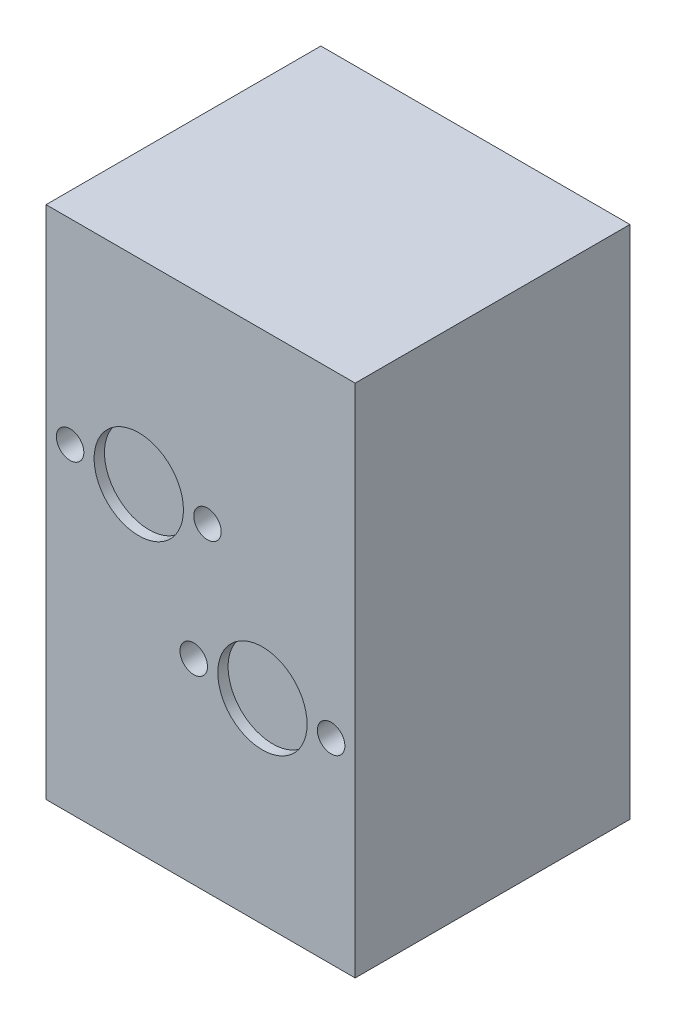
ISO-10303-21;
HEADER;
FILE_DESCRIPTION(('STEP AP214'),'2;1');
FILE_NAME('part.step','',(''),(''),'','','');
FILE_SCHEMA(('AUTOMOTIVE_DESIGN { 1 0 10303 214 1 1 1 1 }'));
ENDSEC;
DATA;
#1=APPLICATION_CONTEXT('core data for automotive mechanical design processes');
#2=APPLICATION_PROTOCOL_DEFINITION('international standard','automotive_design',2000,#1);
#3=PRODUCT_CONTEXT('',#1,'mechanical');
#4=PRODUCT('Part','Part','',(#3));
#5=PRODUCT_RELATED_PRODUCT_CATEGORY('part','',(#4));
#6=PRODUCT_DEFINITION_FORMATION('','',#4);
#7=PRODUCT_DEFINITION_CONTEXT('part definition',#1,'design');
#8=PRODUCT_DEFINITION('design','',#6,#7);
#9=PRODUCT_DEFINITION_SHAPE('','',#8);
#10=(LENGTH_UNIT() NAMED_UNIT(*) SI_UNIT(.MILLI.,.METRE.));
#11=(NAMED_UNIT(*) PLANE_ANGLE_UNIT() SI_UNIT($,.RADIAN.));
#12=(NAMED_UNIT(*) SI_UNIT($,.STERADIAN.) SOLID_ANGLE_UNIT());
#13=UNCERTAINTY_MEASURE_WITH_UNIT(LENGTH_MEASURE(1.E-05),#10,'distance_accuracy_value','');
#14=(GEOMETRIC_REPRESENTATION_CONTEXT(3) GLOBAL_UNCERTAINTY_ASSIGNED_CONTEXT((#13)) GLOBAL_UNIT_ASSIGNED_CONTEXT((#10,
#11,#12)) REPRESENTATION_CONTEXT('',''));
#15=CARTESIAN_POINT('',(0.,0.,0.));
#16=DIRECTION('',(0.,0.,1.));
#17=DIRECTION('',(1.,0.,0.));
#18=AXIS2_PLACEMENT_3D('',#15,#16,#17);
#19=CARTESIAN_POINT('',(45.,75.,80.));
#20=DIRECTION('',(-1.,0.,0.));
#21=DIRECTION('',(0.,-1.,0.));
#22=AXIS2_PLACEMENT_3D('',#19,#20,#21);
#23=PLANE('',#22);
#24=DIRECTION('',(0.,1.,0.));
#25=VECTOR('',#24,1.);
#26=CARTESIAN_POINT('',(45.,75.,0.));
#27=LINE('',#26,#25);
#28=CARTESIAN_POINT('',(45.,-75.,0.));
#29=VERTEX_POINT('',#28);
#30=CARTESIAN_POINT('',(45.,75.,0.));
#31=VERTEX_POINT('',#30);
#32=EDGE_CURVE('E95',#29,#31,#27,.T.);
#33=ORIENTED_EDGE('',*,*,#32,.T.);
#34=DIRECTION('',(0.,0.,-1.));
#35=VECTOR('',#34,1.);
#36=CARTESIAN_POINT('',(45.,75.,80.));
#37=LINE('',#36,#35);
#38=CARTESIAN_POINT('',(45.,75.,80.));
#39=VERTEX_POINT('',#38);
#40=EDGE_CURVE('E11',#39,#31,#37,.T.);
#41=ORIENTED_EDGE('',*,*,#40,.F.);
#42=DIRECTION('',(0.,1.,0.));
#43=VECTOR('',#42,1.);
#44=CARTESIAN_POINT('',(45.,75.,80.));
#45=LINE('',#44,#43);
#46=CARTESIAN_POINT('',(45.,-75.,80.));
#47=VERTEX_POINT('',#46);
#48=EDGE_CURVE('E83',#47,#39,#45,.T.);
#49=ORIENTED_EDGE('',*,*,#48,.F.);
#50=DIRECTION('',(0.,0.,-1.));
#51=VECTOR('',#50,1.);
#52=CARTESIAN_POINT('',(45.,-75.,80.));
#53=LINE('',#52,#51);
#54=EDGE_CURVE('E91',#47,#29,#53,.T.);
#55=ORIENTED_EDGE('',*,*,#54,.T.);
#56=EDGE_LOOP('',(#33,#41,#49,#55));
#57=FACE_BOUND('',#56,.T.);
#58=ADVANCED_FACE('F32',(#57),#23,.F.);
#59=CARTESIAN_POINT('',(-45.,75.,80.));
#60=DIRECTION('',(0.,-1.,0.));
#61=DIRECTION('',(0.,0.,-1.));
#62=AXIS2_PLACEMENT_3D('',#59,#60,#61);
#63=PLANE('',#62);
#64=DIRECTION('',(-1.,0.,0.));
#65=VECTOR('',#64,1.);
#66=CARTESIAN_POINT('',(-45.,75.,0.));
#67=LINE('',#66,#65);
#68=CARTESIAN_POINT('',(-45.,75.,0.));
#69=VERTEX_POINT('',#68);
#70=EDGE_CURVE('E87',#31,#69,#67,.T.);
#71=ORIENTED_EDGE('',*,*,#70,.T.);
#72=DIRECTION('',(0.,0.,-1.));
#73=VECTOR('',#72,1.);
#74=CARTESIAN_POINT('',(-45.,75.,80.));
#75=LINE('',#74,#73);
#76=CARTESIAN_POINT('',(-45.,75.,80.));
#77=VERTEX_POINT('',#76);
#78=EDGE_CURVE('E40',#77,#69,#75,.T.);
#79=ORIENTED_EDGE('',*,*,#78,.F.);
#80=DIRECTION('',(-1.,0.,0.));
#81=VECTOR('',#80,1.);
#82=CARTESIAN_POINT('',(-45.,75.,80.));
#83=LINE('',#82,#81);
#84=EDGE_CURVE('E78',#39,#77,#83,.T.);
#85=ORIENTED_EDGE('',*,*,#84,.F.);
#86=ORIENTED_EDGE('',*,*,#40,.T.);
#87=EDGE_LOOP('',(#71,#79,#85,#86));
#88=FACE_BOUND('',#87,.T.);
#89=ADVANCED_FACE('F86',(#88),#63,.F.);
#90=CARTESIAN_POINT('',(-45.,75.,80.));
#91=DIRECTION('',(1.,0.,0.));
#92=DIRECTION('',(0.,1.,0.));
#93=AXIS2_PLACEMENT_3D('',#90,#91,#92);
#94=PLANE('',#93);
#95=DIRECTION('',(0.,-1.,0.));
#96=VECTOR('',#95,1.);
#97=CARTESIAN_POINT('',(-45.,75.,0.));
#98=LINE('',#97,#96);
#99=CARTESIAN_POINT('',(-45.,-75.,0.));
#100=VERTEX_POINT('',#99);
#101=EDGE_CURVE('E65',#69,#100,#98,.T.);
#102=ORIENTED_EDGE('',*,*,#101,.T.);
#103=DIRECTION('',(0.,0.,-1.));
#104=VECTOR('',#103,1.);
#105=CARTESIAN_POINT('',(-45.,-75.,80.));
#106=LINE('',#105,#104);
#107=CARTESIAN_POINT('',(-45.,-75.,80.));
#108=VERTEX_POINT('',#107);
#109=EDGE_CURVE('E88',#108,#100,#106,.T.);
#110=ORIENTED_EDGE('',*,*,#109,.F.);
#111=DIRECTION('',(0.,-1.,0.));
#112=VECTOR('',#111,1.);
#113=CARTESIAN_POINT('',(-45.,75.,80.));
#114=LINE('',#113,#112);
#115=EDGE_CURVE('E81',#77,#108,#114,.T.);
#116=ORIENTED_EDGE('',*,*,#115,.F.);
#117=ORIENTED_EDGE('',*,*,#78,.T.);
#118=EDGE_LOOP('',(#102,#110,#116,#117));
#119=FACE_BOUND('',#118,.T.);
#120=ADVANCED_FACE('F89',(#119),#94,.F.);
#121=CARTESIAN_POINT('',(-45.,-75.,80.));
#122=DIRECTION('',(0.,1.,0.));
#123=DIRECTION('',(0.,0.,1.));
#124=AXIS2_PLACEMENT_3D('',#121,#122,#123);
#125=PLANE('',#124);
#126=DIRECTION('',(1.,0.,0.));
#127=VECTOR('',#126,1.);
#128=CARTESIAN_POINT('',(-45.,-75.,0.));
#129=LINE('',#128,#127);
#130=EDGE_CURVE('E71',#100,#29,#129,.T.);
#131=ORIENTED_EDGE('',*,*,#130,.T.);
#132=ORIENTED_EDGE('',*,*,#54,.F.);
#133=DIRECTION('',(1.,0.,0.));
#134=VECTOR('',#133,1.);
#135=CARTESIAN_POINT('',(-45.,-75.,80.));
#136=LINE('',#135,#134);
#137=EDGE_CURVE('E48',#108,#47,#136,.T.);
#138=ORIENTED_EDGE('',*,*,#137,.F.);
#139=ORIENTED_EDGE('',*,*,#109,.T.);
#140=EDGE_LOOP('',(#131,#132,#138,#139));
#141=FACE_BOUND('',#140,.T.);
#142=ADVANCED_FACE('F103',(#141),#125,.F.);
#143=CARTESIAN_POINT('',(45.,-75.,80.));
#144=DIRECTION('',(0.,0.,1.));
#145=DIRECTION('',(1.,0.,0.));
#146=AXIS2_PLACEMENT_3D('',#143,#144,#145);
#147=PLANE('',#146);
#148=CARTESIAN_POINT('',(38.0000000000005,-17.9999999999995,80.));
#149=DIRECTION('',(0.,0.,1.));
#150=DIRECTION('',(1.,0.,0.));
#151=AXIS2_PLACEMENT_3D('',#148,#149,#150);
#152=CIRCLE('',#151,4.00000000000084);
#153=CARTESIAN_POINT('',(42.0000000000013,-17.9999999999995,80.));
#154=VERTEX_POINT('',#153);
#155=EDGE_CURVE('E139',#154,#154,#152,.T.);
#156=ORIENTED_EDGE('',*,*,#155,.F.);
#157=EDGE_LOOP('',(#156));
#158=FACE_BOUND('',#157,.T.);
#159=CARTESIAN_POINT('',(-2.00000000000013,-18.,80.));
#160=DIRECTION('',(0.,0.,1.));
#161=DIRECTION('',(1.,0.,0.));
#162=AXIS2_PLACEMENT_3D('',#159,#160,#161);
#163=CIRCLE('',#162,4.);
#164=CARTESIAN_POINT('',(1.99999999999987,-18.,80.));
#165=VERTEX_POINT('',#164);
#166=EDGE_CURVE('E133',#165,#165,#163,.T.);
#167=ORIENTED_EDGE('',*,*,#166,.F.);
#168=EDGE_LOOP('',(#167));
#169=FACE_BOUND('',#168,.T.);
#170=CARTESIAN_POINT('',(-38.,18.,80.));
#171=DIRECTION('',(0.,0.,1.));
#172=DIRECTION('',(1.,0.,0.));
#173=AXIS2_PLACEMENT_3D('',#170,#171,#172);
#174=CIRCLE('',#173,4.00000000000001);
#175=CARTESIAN_POINT('',(-34.,18.,80.));
#176=VERTEX_POINT('',#175);
#177=EDGE_CURVE('E127',#176,#176,#174,.T.);
#178=ORIENTED_EDGE('',*,*,#177,.F.);
#179=EDGE_LOOP('',(#178));
#180=FACE_BOUND('',#179,.T.);
#181=CARTESIAN_POINT('',(2.,18.,80.));
#182=DIRECTION('',(0.,0.,1.));
#183=DIRECTION('',(1.,0.,0.));
#184=AXIS2_PLACEMENT_3D('',#181,#182,#183);
#185=CIRCLE('',#184,4.);
#186=CARTESIAN_POINT('',(6.,18.,80.));
#187=VERTEX_POINT('',#186);
#188=EDGE_CURVE('E121',#187,#187,#185,.T.);
#189=ORIENTED_EDGE('',*,*,#188,.F.);
#190=EDGE_LOOP('',(#189));
#191=FACE_BOUND('',#190,.T.);
#192=CARTESIAN_POINT('',(-18.,18.,80.));
#193=DIRECTION('',(0.,0.,1.));
#194=DIRECTION('',(1.,0.,0.));
#195=AXIS2_PLACEMENT_3D('',#192,#193,#194);
#196=CIRCLE('',#195,13.);
#197=CARTESIAN_POINT('',(-5.,18.,80.));
#198=VERTEX_POINT('',#197);
#199=EDGE_CURVE('E115',#198,#198,#196,.T.);
#200=ORIENTED_EDGE('',*,*,#199,.F.);
#201=EDGE_LOOP('',(#200));
#202=FACE_BOUND('',#201,.T.);
#203=CARTESIAN_POINT('',(18.,-18.,80.));
#204=DIRECTION('',(0.,0.,1.));
#205=DIRECTION('',(1.,0.,0.));
#206=AXIS2_PLACEMENT_3D('',#203,#204,#205);
#207=CIRCLE('',#206,13.);
#208=CARTESIAN_POINT('',(31.,-18.,80.));
#209=VERTEX_POINT('',#208);
#210=EDGE_CURVE('E109',#209,#209,#207,.T.);
#211=ORIENTED_EDGE('',*,*,#210,.F.);
#212=EDGE_LOOP('',(#211));
#213=FACE_BOUND('',#212,.T.);
#214=ORIENTED_EDGE('',*,*,#48,.T.);
#215=ORIENTED_EDGE('',*,*,#84,.T.);
#216=ORIENTED_EDGE('',*,*,#115,.T.);
#217=ORIENTED_EDGE('',*,*,#137,.T.);
#218=EDGE_LOOP('',(#214,#215,#216,#217));
#219=FACE_BOUND('',#218,.T.);
#220=ADVANCED_FACE('F79',(#158,#169,#180,#191,#202,#213,#219),#147,.T.);
#221=CARTESIAN_POINT('',(45.,-75.,0.));
#222=DIRECTION('',(0.,0.,1.));
#223=DIRECTION('',(1.,0.,0.));
#224=AXIS2_PLACEMENT_3D('',#221,#222,#223);
#225=PLANE('',#224);
#226=CARTESIAN_POINT('',(-19.4999999999999,60.3729833462074,0.));
#227=DIRECTION('',(0.,0.,-1.));
#228=DIRECTION('',(-1.,0.,0.));
#229=AXIS2_PLACEMENT_3D('',#226,#227,#228);
#230=CIRCLE('',#229,4.);
#231=CARTESIAN_POINT('',(-23.4999999999999,60.3729833462074,0.));
#232=VERTEX_POINT('',#231);
#233=EDGE_CURVE('E187',#232,#232,#230,.T.);
#234=ORIENTED_EDGE('',*,*,#233,.F.);
#235=EDGE_LOOP('',(#234));
#236=FACE_BOUND('',#235,.T.);
#237=CARTESIAN_POINT('',(-19.4999999999999,34.6270166537926,0.));
#238=DIRECTION('',(0.,0.,-1.));
#239=DIRECTION('',(-1.,0.,0.));
#240=AXIS2_PLACEMENT_3D('',#237,#238,#239);
#241=CIRCLE('',#240,4.);
#242=CARTESIAN_POINT('',(-23.4999999999999,34.6270166537926,0.));
#243=VERTEX_POINT('',#242);
#244=EDGE_CURVE('E181',#243,#243,#241,.T.);
#245=ORIENTED_EDGE('',*,*,#244,.F.);
#246=EDGE_LOOP('',(#245));
#247=FACE_BOUND('',#246,.T.);
#248=CARTESIAN_POINT('',(-19.5,-60.3729833462074,0.));
#249=DIRECTION('',(0.,0.,-1.));
#250=DIRECTION('',(-1.,0.,0.));
#251=AXIS2_PLACEMENT_3D('',#248,#249,#250);
#252=CIRCLE('',#251,4.);
#253=CARTESIAN_POINT('',(-23.5,-60.3729833462074,0.));
#254=VERTEX_POINT('',#253);
#255=EDGE_CURVE('E175',#254,#254,#252,.T.);
#256=ORIENTED_EDGE('',*,*,#255,.F.);
#257=EDGE_LOOP('',(#256));
#258=FACE_BOUND('',#257,.T.);
#259=CARTESIAN_POINT('',(19.5,-60.3729833462074,0.));
#260=DIRECTION('',(0.,0.,-1.));
#261=DIRECTION('',(-1.,0.,0.));
#262=AXIS2_PLACEMENT_3D('',#259,#260,#261);
#263=CIRCLE('',#262,4.);
#264=CARTESIAN_POINT('',(15.5,-60.3729833462074,0.));
#265=VERTEX_POINT('',#264);
#266=EDGE_CURVE('E169',#265,#265,#263,.T.);
#267=ORIENTED_EDGE('',*,*,#266,.F.);
#268=EDGE_LOOP('',(#267));
#269=FACE_BOUND('',#268,.T.);
#270=CARTESIAN_POINT('',(19.5,34.6270166537926,0.));
#271=DIRECTION('',(0.,0.,-1.));
#272=DIRECTION('',(-1.,0.,0.));
#273=AXIS2_PLACEMENT_3D('',#270,#271,#272);
#274=CIRCLE('',#273,4.);
#275=CARTESIAN_POINT('',(15.5,34.6270166537926,0.));
#276=VERTEX_POINT('',#275);
#277=EDGE_CURVE('E163',#276,#276,#274,.T.);
#278=ORIENTED_EDGE('',*,*,#277,.F.);
#279=EDGE_LOOP('',(#278));
#280=FACE_BOUND('',#279,.T.);
#281=CARTESIAN_POINT('',(-19.5,-34.6270166537926,0.));
#282=DIRECTION('',(0.,0.,-1.));
#283=DIRECTION('',(-1.,0.,0.));
#284=AXIS2_PLACEMENT_3D('',#281,#282,#283);
#285=CIRCLE('',#284,4.);
#286=CARTESIAN_POINT('',(-23.5,-34.6270166537926,0.));
#287=VERTEX_POINT('',#286);
#288=EDGE_CURVE('E157',#287,#287,#285,.T.);
#289=ORIENTED_EDGE('',*,*,#288,.F.);
#290=EDGE_LOOP('',(#289));
#291=FACE_BOUND('',#290,.T.);
#292=CARTESIAN_POINT('',(19.5,-34.6270166537926,0.));
#293=DIRECTION('',(0.,0.,-1.));
#294=DIRECTION('',(-1.,0.,0.));
#295=AXIS2_PLACEMENT_3D('',#292,#293,#294);
#296=CIRCLE('',#295,4.);
#297=CARTESIAN_POINT('',(15.5,-34.6270166537926,0.));
#298=VERTEX_POINT('',#297);
#299=EDGE_CURVE('E151',#298,#298,#296,.T.);
#300=ORIENTED_EDGE('',*,*,#299,.F.);
#301=EDGE_LOOP('',(#300));
#302=FACE_BOUND('',#301,.T.);
#303=CARTESIAN_POINT('',(19.5,60.3729833462074,0.));
#304=DIRECTION('',(0.,0.,-1.));
#305=DIRECTION('',(-1.,0.,0.));
#306=AXIS2_PLACEMENT_3D('',#303,#304,#305);
#307=CIRCLE('',#306,4.);
#308=CARTESIAN_POINT('',(15.5,60.3729833462074,0.));
#309=VERTEX_POINT('',#308);
#310=EDGE_CURVE('E145',#309,#309,#307,.T.);
#311=ORIENTED_EDGE('',*,*,#310,.F.);
#312=EDGE_LOOP('',(#311));
#313=FACE_BOUND('',#312,.T.);
#314=ORIENTED_EDGE('',*,*,#32,.F.);
#315=ORIENTED_EDGE('',*,*,#130,.F.);
#316=ORIENTED_EDGE('',*,*,#101,.F.);
#317=ORIENTED_EDGE('',*,*,#70,.F.);
#318=EDGE_LOOP('',(#314,#315,#316,#317));
#319=FACE_BOUND('',#318,.T.);
#320=ADVANCED_FACE('F106',(#236,#247,#258,#269,#280,#291,#302,#313,#319),#225,.F.);
#321=CARTESIAN_POINT('',(18.,-18.,77.));
#322=DIRECTION('',(0.,0.,1.));
#323=DIRECTION('',(1.,0.,0.));
#324=AXIS2_PLACEMENT_3D('',#321,#322,#323);
#325=CYLINDRICAL_SURFACE('',#324,13.);
#326=CARTESIAN_POINT('',(18.,-18.,77.));
#327=DIRECTION('',(0.,0.,1.));
#328=DIRECTION('',(1.,0.,0.));
#329=AXIS2_PLACEMENT_3D('',#326,#327,#328);
#330=CIRCLE('',#329,13.);
#331=CARTESIAN_POINT('',(31.,-18.,77.));
#332=VERTEX_POINT('',#331);
#333=EDGE_CURVE('E98',#332,#332,#330,.T.);
#334=ORIENTED_EDGE('',*,*,#333,.F.);
#335=EDGE_LOOP('',(#334));
#336=FACE_BOUND('',#335,.T.);
#337=ORIENTED_EDGE('',*,*,#210,.T.);
#338=EDGE_LOOP('',(#337));
#339=FACE_BOUND('',#338,.T.);
#340=ADVANCED_FACE('F204',(#336,#339),#325,.F.);
#341=CARTESIAN_POINT('',(18.,-18.,77.));
#342=DIRECTION('',(0.,0.,1.));
#343=DIRECTION('',(1.,0.,0.));
#344=AXIS2_PLACEMENT_3D('',#341,#342,#343);
#345=PLANE('',#344);
#346=ORIENTED_EDGE('',*,*,#333,.T.);
#347=EDGE_LOOP('',(#346));
#348=FACE_BOUND('',#347,.T.);
#349=ADVANCED_FACE('F253',(#348),#345,.T.);
#350=CARTESIAN_POINT('',(-18.,18.,77.));
#351=DIRECTION('',(0.,0.,1.));
#352=DIRECTION('',(1.,0.,0.));
#353=AXIS2_PLACEMENT_3D('',#350,#351,#352);
#354=CYLINDRICAL_SURFACE('',#353,13.);
#355=CARTESIAN_POINT('',(-18.,18.,77.));
#356=DIRECTION('',(0.,0.,1.));
#357=DIRECTION('',(1.,0.,0.));
#358=AXIS2_PLACEMENT_3D('',#355,#356,#357);
#359=CIRCLE('',#358,13.);
#360=CARTESIAN_POINT('',(-5.,18.,77.));
#361=VERTEX_POINT('',#360);
#362=EDGE_CURVE('E112',#361,#361,#359,.T.);
#363=ORIENTED_EDGE('',*,*,#362,.F.);
#364=EDGE_LOOP('',(#363));
#365=FACE_BOUND('',#364,.T.);
#366=ORIENTED_EDGE('',*,*,#199,.T.);
#367=EDGE_LOOP('',(#366));
#368=FACE_BOUND('',#367,.T.);
#369=ADVANCED_FACE('F257',(#365,#368),#354,.F.);
#370=CARTESIAN_POINT('',(-18.,18.,77.));
#371=DIRECTION('',(0.,0.,1.));
#372=DIRECTION('',(1.,0.,0.));
#373=AXIS2_PLACEMENT_3D('',#370,#371,#372);
#374=PLANE('',#373);
#375=ORIENTED_EDGE('',*,*,#362,.T.);
#376=EDGE_LOOP('',(#375));
#377=FACE_BOUND('',#376,.T.);
#378=ADVANCED_FACE('F261',(#377),#374,.T.);
#379=CARTESIAN_POINT('',(2.,18.,70.));
#380=DIRECTION('',(0.,0.,1.));
#381=DIRECTION('',(1.,0.,0.));
#382=AXIS2_PLACEMENT_3D('',#379,#380,#381);
#383=CYLINDRICAL_SURFACE('',#382,4.);
#384=CARTESIAN_POINT('',(2.,18.,70.));
#385=DIRECTION('',(0.,0.,1.));
#386=DIRECTION('',(1.,0.,0.));
#387=AXIS2_PLACEMENT_3D('',#384,#385,#386);
#388=CIRCLE('',#387,4.);
#389=CARTESIAN_POINT('',(6.,18.,70.));
#390=VERTEX_POINT('',#389);
#391=EDGE_CURVE('E118',#390,#390,#388,.T.);
#392=ORIENTED_EDGE('',*,*,#391,.F.);
#393=EDGE_LOOP('',(#392));
#394=FACE_BOUND('',#393,.T.);
#395=ORIENTED_EDGE('',*,*,#188,.T.);
#396=EDGE_LOOP('',(#395));
#397=FACE_BOUND('',#396,.T.);
#398=ADVANCED_FACE('F265',(#394,#397),#383,.F.);
#399=CARTESIAN_POINT('',(2.,18.,70.));
#400=DIRECTION('',(0.,0.,1.));
#401=DIRECTION('',(1.,0.,0.));
#402=AXIS2_PLACEMENT_3D('',#399,#400,#401);
#403=PLANE('',#402);
#404=ORIENTED_EDGE('',*,*,#391,.T.);
#405=EDGE_LOOP('',(#404));
#406=FACE_BOUND('',#405,.T.);
#407=ADVANCED_FACE('F269',(#406),#403,.T.);
#408=CARTESIAN_POINT('',(-38.,18.,70.));
#409=DIRECTION('',(0.,0.,1.));
#410=DIRECTION('',(1.,0.,0.));
#411=AXIS2_PLACEMENT_3D('',#408,#409,#410);
#412=CYLINDRICAL_SURFACE('',#411,4.00000000000001);
#413=CARTESIAN_POINT('',(-38.,18.,70.));
#414=DIRECTION('',(0.,0.,1.));
#415=DIRECTION('',(1.,0.,0.));
#416=AXIS2_PLACEMENT_3D('',#413,#414,#415);
#417=CIRCLE('',#416,4.00000000000001);
#418=CARTESIAN_POINT('',(-34.,18.,70.));
#419=VERTEX_POINT('',#418);
#420=EDGE_CURVE('E124',#419,#419,#417,.T.);
#421=ORIENTED_EDGE('',*,*,#420,.F.);
#422=EDGE_LOOP('',(#421));
#423=FACE_BOUND('',#422,.T.);
#424=ORIENTED_EDGE('',*,*,#177,.T.);
#425=EDGE_LOOP('',(#424));
#426=FACE_BOUND('',#425,.T.);
#427=ADVANCED_FACE('F273',(#423,#426),#412,.F.);
#428=CARTESIAN_POINT('',(-38.,18.,70.));
#429=DIRECTION('',(0.,0.,1.));
#430=DIRECTION('',(1.,0.,0.));
#431=AXIS2_PLACEMENT_3D('',#428,#429,#430);
#432=PLANE('',#431);
#433=ORIENTED_EDGE('',*,*,#420,.T.);
#434=EDGE_LOOP('',(#433));
#435=FACE_BOUND('',#434,.T.);
#436=ADVANCED_FACE('F277',(#435),#432,.T.);
#437=CARTESIAN_POINT('',(-2.00000000000013,-18.,70.));
#438=DIRECTION('',(0.,0.,1.));
#439=DIRECTION('',(1.,0.,0.));
#440=AXIS2_PLACEMENT_3D('',#437,#438,#439);
#441=CYLINDRICAL_SURFACE('',#440,4.);
#442=CARTESIAN_POINT('',(-2.00000000000013,-18.,70.));
#443=DIRECTION('',(0.,0.,1.));
#444=DIRECTION('',(1.,0.,0.));
#445=AXIS2_PLACEMENT_3D('',#442,#443,#444);
#446=CIRCLE('',#445,4.);
#447=CARTESIAN_POINT('',(1.99999999999987,-18.,70.));
#448=VERTEX_POINT('',#447);
#449=EDGE_CURVE('E130',#448,#448,#446,.T.);
#450=ORIENTED_EDGE('',*,*,#449,.F.);
#451=EDGE_LOOP('',(#450));
#452=FACE_BOUND('',#451,.T.);
#453=ORIENTED_EDGE('',*,*,#166,.T.);
#454=EDGE_LOOP('',(#453));
#455=FACE_BOUND('',#454,.T.);
#456=ADVANCED_FACE('F281',(#452,#455),#441,.F.);
#457=CARTESIAN_POINT('',(-2.00000000000013,-18.,70.));
#458=DIRECTION('',(0.,0.,1.));
#459=DIRECTION('',(1.,0.,0.));
#460=AXIS2_PLACEMENT_3D('',#457,#458,#459);
#461=PLANE('',#460);
#462=ORIENTED_EDGE('',*,*,#449,.T.);
#463=EDGE_LOOP('',(#462));
#464=FACE_BOUND('',#463,.T.);
#465=ADVANCED_FACE('F285',(#464),#461,.T.);
#466=CARTESIAN_POINT('',(38.0000000000005,-17.9999999999995,70.));
#467=DIRECTION('',(0.,0.,1.));
#468=DIRECTION('',(1.,0.,0.));
#469=AXIS2_PLACEMENT_3D('',#466,#467,#468);
#470=CYLINDRICAL_SURFACE('',#469,4.00000000000084);
#471=CARTESIAN_POINT('',(38.0000000000005,-17.9999999999995,70.));
#472=DIRECTION('',(0.,0.,1.));
#473=DIRECTION('',(1.,0.,0.));
#474=AXIS2_PLACEMENT_3D('',#471,#472,#473);
#475=CIRCLE('',#474,4.00000000000084);
#476=CARTESIAN_POINT('',(42.0000000000013,-17.9999999999995,70.));
#477=VERTEX_POINT('',#476);
#478=EDGE_CURVE('E136',#477,#477,#475,.T.);
#479=ORIENTED_EDGE('',*,*,#478,.F.);
#480=EDGE_LOOP('',(#479));
#481=FACE_BOUND('',#480,.T.);
#482=ORIENTED_EDGE('',*,*,#155,.T.);
#483=EDGE_LOOP('',(#482));
#484=FACE_BOUND('',#483,.T.);
#485=ADVANCED_FACE('F233',(#481,#484),#470,.F.);
#486=CARTESIAN_POINT('',(38.0000000000005,-17.9999999999995,70.));
#487=DIRECTION('',(0.,0.,1.));
#488=DIRECTION('',(1.,0.,0.));
#489=AXIS2_PLACEMENT_3D('',#486,#487,#488);
#490=PLANE('',#489);
#491=ORIENTED_EDGE('',*,*,#478,.T.);
#492=EDGE_LOOP('',(#491));
#493=FACE_BOUND('',#492,.T.);
#494=ADVANCED_FACE('F223',(#493),#490,.T.);
#495=CARTESIAN_POINT('',(19.5,60.3729833462074,7.));
#496=DIRECTION('',(0.,0.,-1.));
#497=DIRECTION('',(-1.,0.,0.));
#498=AXIS2_PLACEMENT_3D('',#495,#496,#497);
#499=CYLINDRICAL_SURFACE('',#498,4.);
#500=CARTESIAN_POINT('',(19.5,60.3729833462074,7.));
#501=DIRECTION('',(0.,0.,-1.));
#502=DIRECTION('',(-1.,0.,0.));
#503=AXIS2_PLACEMENT_3D('',#500,#501,#502);
#504=CIRCLE('',#503,4.);
#505=CARTESIAN_POINT('',(15.5,60.3729833462074,7.));
#506=VERTEX_POINT('',#505);
#507=EDGE_CURVE('E142',#506,#506,#504,.T.);
#508=ORIENTED_EDGE('',*,*,#507,.F.);
#509=EDGE_LOOP('',(#508));
#510=FACE_BOUND('',#509,.T.);
#511=ORIENTED_EDGE('',*,*,#310,.T.);
#512=EDGE_LOOP('',(#511));
#513=FACE_BOUND('',#512,.T.);
#514=ADVANCED_FACE('F220',(#510,#513),#499,.F.);
#515=CARTESIAN_POINT('',(19.5,60.3729833462074,7.));
#516=DIRECTION('',(0.,0.,-1.));
#517=DIRECTION('',(-1.,0.,0.));
#518=AXIS2_PLACEMENT_3D('',#515,#516,#517);
#519=PLANE('',#518);
#520=ORIENTED_EDGE('',*,*,#507,.T.);
#521=EDGE_LOOP('',(#520));
#522=FACE_BOUND('',#521,.T.);
#523=ADVANCED_FACE('F222',(#522),#519,.T.);
#524=CARTESIAN_POINT('',(19.5,-34.6270166537926,7.));
#525=DIRECTION('',(0.,0.,-1.));
#526=DIRECTION('',(-1.,0.,0.));
#527=AXIS2_PLACEMENT_3D('',#524,#525,#526);
#528=CYLINDRICAL_SURFACE('',#527,4.);
#529=CARTESIAN_POINT('',(19.5,-34.6270166537926,7.));
#530=DIRECTION('',(0.,0.,-1.));
#531=DIRECTION('',(-1.,0.,0.));
#532=AXIS2_PLACEMENT_3D('',#529,#530,#531);
#533=CIRCLE('',#532,4.);
#534=CARTESIAN_POINT('',(15.5,-34.6270166537926,7.));
#535=VERTEX_POINT('',#534);
#536=EDGE_CURVE('E148',#535,#535,#533,.T.);
#537=ORIENTED_EDGE('',*,*,#536,.F.);
#538=EDGE_LOOP('',(#537));
#539=FACE_BOUND('',#538,.T.);
#540=ORIENTED_EDGE('',*,*,#299,.T.);
#541=EDGE_LOOP('',(#540));
#542=FACE_BOUND('',#541,.T.);
#543=ADVANCED_FACE('F230',(#539,#542),#528,.F.);
#544=CARTESIAN_POINT('',(19.5,-34.6270166537926,7.));
#545=DIRECTION('',(0.,0.,-1.));
#546=DIRECTION('',(-1.,0.,0.));
#547=AXIS2_PLACEMENT_3D('',#544,#545,#546);
#548=PLANE('',#547);
#549=ORIENTED_EDGE('',*,*,#536,.T.);
#550=EDGE_LOOP('',(#549));
#551=FACE_BOUND('',#550,.T.);
#552=ADVANCED_FACE('F345',(#551),#548,.T.);
#553=CARTESIAN_POINT('',(-19.5,-34.6270166537926,7.));
#554=DIRECTION('',(0.,0.,-1.));
#555=DIRECTION('',(-1.,0.,0.));
#556=AXIS2_PLACEMENT_3D('',#553,#554,#555);
#557=CYLINDRICAL_SURFACE('',#556,4.);
#558=CARTESIAN_POINT('',(-19.5,-34.6270166537926,7.));
#559=DIRECTION('',(0.,0.,-1.));
#560=DIRECTION('',(-1.,0.,0.));
#561=AXIS2_PLACEMENT_3D('',#558,#559,#560);
#562=CIRCLE('',#561,4.);
#563=CARTESIAN_POINT('',(-23.5,-34.6270166537926,7.));
#564=VERTEX_POINT('',#563);
#565=EDGE_CURVE('E154',#564,#564,#562,.T.);
#566=ORIENTED_EDGE('',*,*,#565,.F.);
#567=EDGE_LOOP('',(#566));
#568=FACE_BOUND('',#567,.T.);
#569=ORIENTED_EDGE('',*,*,#288,.T.);
#570=EDGE_LOOP('',(#569));
#571=FACE_BOUND('',#570,.T.);
#572=ADVANCED_FACE('F355',(#568,#571),#557,.F.);
#573=CARTESIAN_POINT('',(-19.5,-34.6270166537926,7.));
#574=DIRECTION('',(0.,0.,-1.));
#575=DIRECTION('',(-1.,0.,0.));
#576=AXIS2_PLACEMENT_3D('',#573,#574,#575);
#577=PLANE('',#576);
#578=ORIENTED_EDGE('',*,*,#565,.T.);
#579=EDGE_LOOP('',(#578));
#580=FACE_BOUND('',#579,.T.);
#581=ADVANCED_FACE('F365',(#580),#577,.T.);
#582=CARTESIAN_POINT('',(19.5,34.6270166537926,7.));
#583=DIRECTION('',(0.,0.,-1.));
#584=DIRECTION('',(-1.,0.,0.));
#585=AXIS2_PLACEMENT_3D('',#582,#583,#584);
#586=CYLINDRICAL_SURFACE('',#585,4.);
#587=CARTESIAN_POINT('',(19.5,34.6270166537926,7.));
#588=DIRECTION('',(0.,0.,-1.));
#589=DIRECTION('',(-1.,0.,0.));
#590=AXIS2_PLACEMENT_3D('',#587,#588,#589);
#591=CIRCLE('',#590,4.);
#592=CARTESIAN_POINT('',(15.5,34.6270166537926,7.));
#593=VERTEX_POINT('',#592);
#594=EDGE_CURVE('E160',#593,#593,#591,.T.);
#595=ORIENTED_EDGE('',*,*,#594,.F.);
#596=EDGE_LOOP('',(#595));
#597=FACE_BOUND('',#596,.T.);
#598=ORIENTED_EDGE('',*,*,#277,.T.);
#599=EDGE_LOOP('',(#598));
#600=FACE_BOUND('',#599,.T.);
#601=ADVANCED_FACE('F375',(#597,#600),#586,.F.);
#602=CARTESIAN_POINT('',(19.5,34.6270166537926,7.));
#603=DIRECTION('',(0.,0.,-1.));
#604=DIRECTION('',(-1.,0.,0.));
#605=AXIS2_PLACEMENT_3D('',#602,#603,#604);
#606=PLANE('',#605);
#607=ORIENTED_EDGE('',*,*,#594,.T.);
#608=EDGE_LOOP('',(#607));
#609=FACE_BOUND('',#608,.T.);
#610=ADVANCED_FACE('F385',(#609),#606,.T.);
#611=CARTESIAN_POINT('',(19.5,-60.3729833462074,7.));
#612=DIRECTION('',(0.,0.,-1.));
#613=DIRECTION('',(-1.,0.,0.));
#614=AXIS2_PLACEMENT_3D('',#611,#612,#613);
#615=CYLINDRICAL_SURFACE('',#614,4.);
#616=CARTESIAN_POINT('',(19.5,-60.3729833462074,7.));
#617=DIRECTION('',(0.,0.,-1.));
#618=DIRECTION('',(-1.,0.,0.));
#619=AXIS2_PLACEMENT_3D('',#616,#617,#618);
#620=CIRCLE('',#619,4.);
#621=CARTESIAN_POINT('',(15.5,-60.3729833462074,7.));
#622=VERTEX_POINT('',#621);
#623=EDGE_CURVE('E166',#622,#622,#620,.T.);
#624=ORIENTED_EDGE('',*,*,#623,.F.);
#625=EDGE_LOOP('',(#624));
#626=FACE_BOUND('',#625,.T.);
#627=ORIENTED_EDGE('',*,*,#266,.T.);
#628=EDGE_LOOP('',(#627));
#629=FACE_BOUND('',#628,.T.);
#630=ADVANCED_FACE('F395',(#626,#629),#615,.F.);
#631=CARTESIAN_POINT('',(19.5,-60.3729833462074,7.));
#632=DIRECTION('',(0.,0.,-1.));
#633=DIRECTION('',(-1.,0.,0.));
#634=AXIS2_PLACEMENT_3D('',#631,#632,#633);
#635=PLANE('',#634);
#636=ORIENTED_EDGE('',*,*,#623,.T.);
#637=EDGE_LOOP('',(#636));
#638=FACE_BOUND('',#637,.T.);
#639=ADVANCED_FACE('F405',(#638),#635,.T.);
#640=CARTESIAN_POINT('',(-19.5,-60.3729833462074,7.));
#641=DIRECTION('',(0.,0.,-1.));
#642=DIRECTION('',(-1.,0.,0.));
#643=AXIS2_PLACEMENT_3D('',#640,#641,#642);
#644=CYLINDRICAL_SURFACE('',#643,4.);
#645=CARTESIAN_POINT('',(-19.5,-60.3729833462074,7.));
#646=DIRECTION('',(0.,0.,-1.));
#647=DIRECTION('',(-1.,0.,0.));
#648=AXIS2_PLACEMENT_3D('',#645,#646,#647);
#649=CIRCLE('',#648,4.);
#650=CARTESIAN_POINT('',(-23.5,-60.3729833462074,7.));
#651=VERTEX_POINT('',#650);
#652=EDGE_CURVE('E172',#651,#651,#649,.T.);
#653=ORIENTED_EDGE('',*,*,#652,.F.);
#654=EDGE_LOOP('',(#653));
#655=FACE_BOUND('',#654,.T.);
#656=ORIENTED_EDGE('',*,*,#255,.T.);
#657=EDGE_LOOP('',(#656));
#658=FACE_BOUND('',#657,.T.);
#659=ADVANCED_FACE('F415',(#655,#658),#644,.F.);
#660=CARTESIAN_POINT('',(-19.5,-60.3729833462074,7.));
#661=DIRECTION('',(0.,0.,-1.));
#662=DIRECTION('',(-1.,0.,0.));
#663=AXIS2_PLACEMENT_3D('',#660,#661,#662);
#664=PLANE('',#663);
#665=ORIENTED_EDGE('',*,*,#652,.T.);
#666=EDGE_LOOP('',(#665));
#667=FACE_BOUND('',#666,.T.);
#668=ADVANCED_FACE('F425',(#667),#664,.T.);
#669=CARTESIAN_POINT('',(-19.4999999999999,34.6270166537926,7.));
#670=DIRECTION('',(0.,0.,-1.));
#671=DIRECTION('',(-1.,0.,0.));
#672=AXIS2_PLACEMENT_3D('',#669,#670,#671);
#673=CYLINDRICAL_SURFACE('',#672,4.);
#674=CARTESIAN_POINT('',(-19.4999999999999,34.6270166537926,7.));
#675=DIRECTION('',(0.,0.,-1.));
#676=DIRECTION('',(-1.,0.,0.));
#677=AXIS2_PLACEMENT_3D('',#674,#675,#676);
#678=CIRCLE('',#677,4.);
#679=CARTESIAN_POINT('',(-23.4999999999999,34.6270166537926,7.));
#680=VERTEX_POINT('',#679);
#681=EDGE_CURVE('E178',#680,#680,#678,.T.);
#682=ORIENTED_EDGE('',*,*,#681,.F.);
#683=EDGE_LOOP('',(#682));
#684=FACE_BOUND('',#683,.T.);
#685=ORIENTED_EDGE('',*,*,#244,.T.);
#686=EDGE_LOOP('',(#685));
#687=FACE_BOUND('',#686,.T.);
#688=ADVANCED_FACE('F435',(#684,#687),#673,.F.);
#689=CARTESIAN_POINT('',(-19.4999999999999,34.6270166537926,7.));
#690=DIRECTION('',(0.,0.,-1.));
#691=DIRECTION('',(-1.,0.,0.));
#692=AXIS2_PLACEMENT_3D('',#689,#690,#691);
#693=PLANE('',#692);
#694=ORIENTED_EDGE('',*,*,#681,.T.);
#695=EDGE_LOOP('',(#694));
#696=FACE_BOUND('',#695,.T.);
#697=ADVANCED_FACE('F198',(#696),#693,.T.);
#698=CARTESIAN_POINT('',(-19.4999999999999,60.3729833462074,7.));
#699=DIRECTION('',(0.,0.,-1.));
#700=DIRECTION('',(-1.,0.,0.));
#701=AXIS2_PLACEMENT_3D('',#698,#699,#700);
#702=CYLINDRICAL_SURFACE('',#701,4.);
#703=CARTESIAN_POINT('',(-19.4999999999999,60.3729833462074,7.));
#704=DIRECTION('',(0.,0.,-1.));
#705=DIRECTION('',(-1.,0.,0.));
#706=AXIS2_PLACEMENT_3D('',#703,#704,#705);
#707=CIRCLE('',#706,4.);
#708=CARTESIAN_POINT('',(-23.4999999999999,60.3729833462074,7.));
#709=VERTEX_POINT('',#708);
#710=EDGE_CURVE('E184',#709,#709,#707,.T.);
#711=ORIENTED_EDGE('',*,*,#710,.F.);
#712=EDGE_LOOP('',(#711));
#713=FACE_BOUND('',#712,.T.);
#714=ORIENTED_EDGE('',*,*,#233,.T.);
#715=EDGE_LOOP('',(#714));
#716=FACE_BOUND('',#715,.T.);
#717=ADVANCED_FACE('F195',(#713,#716),#702,.F.);
#718=CARTESIAN_POINT('',(-19.4999999999999,60.3729833462074,7.));
#719=DIRECTION('',(0.,0.,-1.));
#720=DIRECTION('',(-1.,0.,0.));
#721=AXIS2_PLACEMENT_3D('',#718,#719,#720);
#722=PLANE('',#721);
#723=ORIENTED_EDGE('',*,*,#710,.T.);
#724=EDGE_LOOP('',(#723));
#725=FACE_BOUND('',#724,.T.);
#726=ADVANCED_FACE('F193',(#725),#722,.T.);
#727=CLOSED_SHELL('',(#58,#89,#120,#142,#220,#320,#340,#349,#369,#378,#398,#407,#427,#436,#456,
#465,#485,#494,#514,#523,#543,#552,#572,#581,#601,#610,#630,#639,#659,#668,#688,#697,#717,#726));
#728=MANIFOLD_SOLID_BREP('B2',#727);
#729=ADVANCED_BREP_SHAPE_REPRESENTATION('',(#18,#728),#14);
#730=SHAPE_DEFINITION_REPRESENTATION(#9,#729);
ENDSEC;
END-ISO-10303-21;
